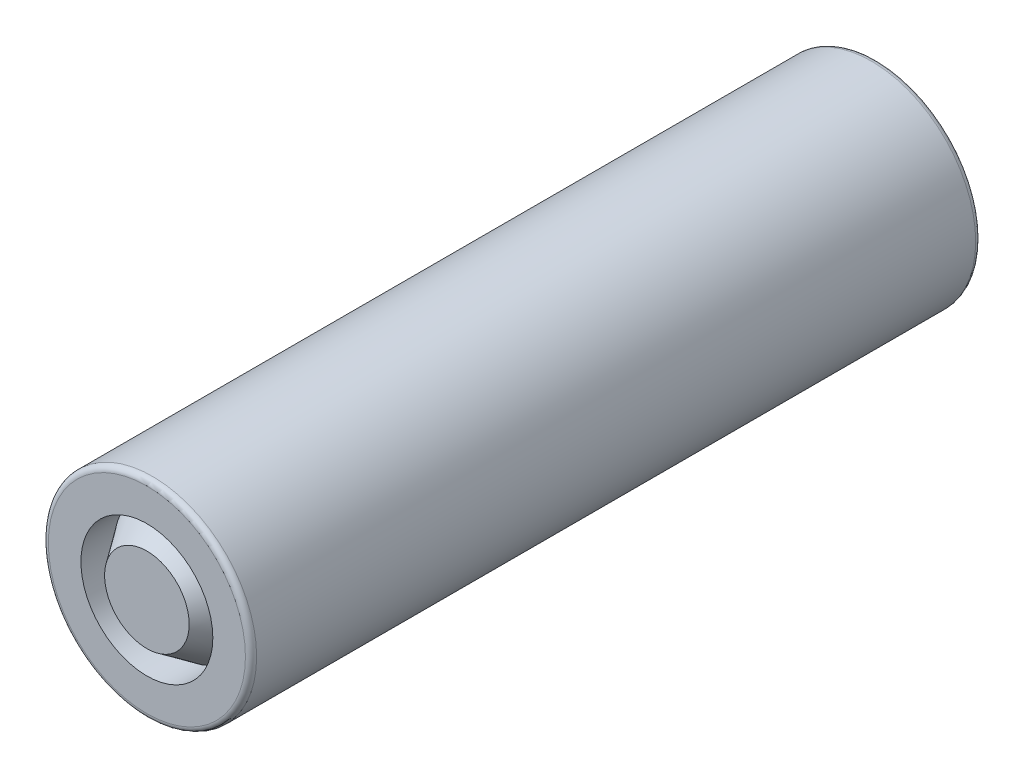
ISO-10303-21;
HEADER;
FILE_DESCRIPTION(('STEP AP214'),'2;1');
FILE_NAME('part.step','',(''),(''),'','','');
FILE_SCHEMA(('AUTOMOTIVE_DESIGN { 1 0 10303 214 1 1 1 1 }'));
ENDSEC;
DATA;
#1=APPLICATION_CONTEXT('core data for automotive mechanical design processes');
#2=APPLICATION_PROTOCOL_DEFINITION('international standard','automotive_design',2000,#1);
#3=PRODUCT_CONTEXT('',#1,'mechanical');
#4=PRODUCT('Part','Part','',(#3));
#5=PRODUCT_RELATED_PRODUCT_CATEGORY('part','',(#4));
#6=PRODUCT_DEFINITION_FORMATION('','',#4);
#7=PRODUCT_DEFINITION_CONTEXT('part definition',#1,'design');
#8=PRODUCT_DEFINITION('design','',#6,#7);
#9=PRODUCT_DEFINITION_SHAPE('','',#8);
#10=(LENGTH_UNIT() NAMED_UNIT(*) SI_UNIT(.MILLI.,.METRE.));
#11=(NAMED_UNIT(*) PLANE_ANGLE_UNIT() SI_UNIT($,.RADIAN.));
#12=(NAMED_UNIT(*) SI_UNIT($,.STERADIAN.) SOLID_ANGLE_UNIT());
#13=UNCERTAINTY_MEASURE_WITH_UNIT(LENGTH_MEASURE(1.E-05),#10,'distance_accuracy_value','');
#14=(GEOMETRIC_REPRESENTATION_CONTEXT(3) GLOBAL_UNCERTAINTY_ASSIGNED_CONTEXT((#13)) GLOBAL_UNIT_ASSIGNED_CONTEXT((#10,
#11,#12)) REPRESENTATION_CONTEXT('',''));
#15=CARTESIAN_POINT('',(0.,0.,0.));
#16=DIRECTION('',(0.,0.,1.));
#17=DIRECTION('',(1.,0.,0.));
#18=AXIS2_PLACEMENT_3D('',#15,#16,#17);
#19=CARTESIAN_POINT('',(0.,0.,0.));
#20=DIRECTION('',(0.,0.,1.));
#21=DIRECTION('',(1.,0.,0.));
#22=AXIS2_PLACEMENT_3D('',#19,#20,#21);
#23=PLANE('',#22);
#24=CARTESIAN_POINT('',(0.,0.,0.));
#25=DIRECTION('',(0.,0.,1.));
#26=DIRECTION('',(1.,0.,0.));
#27=AXIS2_PLACEMENT_3D('',#24,#25,#26);
#28=CIRCLE('',#27,8.8);
#29=CARTESIAN_POINT('',(8.8,0.,0.));
#30=VERTEX_POINT('',#29);
#31=EDGE_CURVE('E10',#30,#30,#28,.T.);
#32=ORIENTED_EDGE('',*,*,#31,.T.);
#33=EDGE_LOOP('',(#32));
#34=FACE_BOUND('',#33,.T.);
#35=CARTESIAN_POINT('',(0.,0.,0.));
#36=DIRECTION('',(0.,0.,1.));
#37=DIRECTION('',(1.,0.,0.));
#38=AXIS2_PLACEMENT_3D('',#35,#36,#37);
#39=CIRCLE('',#38,5.89);
#40=CARTESIAN_POINT('',(5.89,0.,0.));
#41=VERTEX_POINT('',#40);
#42=EDGE_CURVE('E64',#41,#41,#39,.T.);
#43=ORIENTED_EDGE('',*,*,#42,.F.);
#44=EDGE_LOOP('',(#43));
#45=FACE_BOUND('',#44,.T.);
#46=ADVANCED_FACE('F40',(#34,#45),#23,.T.);
#47=CARTESIAN_POINT('',(0.,0.,-65.2));
#48=DIRECTION('',(0.,0.,1.));
#49=DIRECTION('',(1.,0.,0.));
#50=AXIS2_PLACEMENT_3D('',#47,#48,#49);
#51=CYLINDRICAL_SURFACE('',#50,9.3);
#52=CARTESIAN_POINT('',(0.,0.,-64.7));
#53=DIRECTION('',(0.,0.,1.));
#54=DIRECTION('',(1.,0.,0.));
#55=AXIS2_PLACEMENT_3D('',#52,#53,#54);
#56=CIRCLE('',#55,9.3);
#57=CARTESIAN_POINT('',(9.3,0.,-64.7));
#58=VERTEX_POINT('',#57);
#59=EDGE_CURVE('E53',#58,#58,#56,.T.);
#60=ORIENTED_EDGE('',*,*,#59,.T.);
#61=EDGE_LOOP('',(#60));
#62=FACE_BOUND('',#61,.T.);
#63=CARTESIAN_POINT('',(0.,0.,-0.5));
#64=DIRECTION('',(0.,0.,1.));
#65=DIRECTION('',(1.,0.,0.));
#66=AXIS2_PLACEMENT_3D('',#63,#64,#65);
#67=CIRCLE('',#66,9.3);
#68=CARTESIAN_POINT('',(9.3,0.,-0.5));
#69=VERTEX_POINT('',#68);
#70=EDGE_CURVE('E58',#69,#69,#67,.F.);
#71=ORIENTED_EDGE('',*,*,#70,.T.);
#72=EDGE_LOOP('',(#71));
#73=FACE_BOUND('',#72,.T.);
#74=ADVANCED_FACE('F91',(#62,#73),#51,.T.);
#75=CARTESIAN_POINT('',(0.,0.,-65.2));
#76=DIRECTION('',(0.,0.,1.));
#77=DIRECTION('',(1.,0.,0.));
#78=AXIS2_PLACEMENT_3D('',#75,#76,#77);
#79=PLANE('',#78);
#80=CARTESIAN_POINT('',(0.,0.,-65.2));
#81=DIRECTION('',(0.,0.,1.));
#82=DIRECTION('',(1.,0.,0.));
#83=AXIS2_PLACEMENT_3D('',#80,#81,#82);
#84=CIRCLE('',#83,8.8);
#85=CARTESIAN_POINT('',(8.8,0.,-65.2));
#86=VERTEX_POINT('',#85);
#87=EDGE_CURVE('E48',#86,#86,#84,.F.);
#88=ORIENTED_EDGE('',*,*,#87,.T.);
#89=EDGE_LOOP('',(#88));
#90=FACE_BOUND('',#89,.T.);
#91=ADVANCED_FACE('F82',(#90),#79,.F.);
#92=CARTESIAN_POINT('',(0.,0.,55.));
#93=DIRECTION('',(0.,0.,1.));
#94=DIRECTION('',(1.,0.,0.));
#95=AXIS2_PLACEMENT_3D('',#92,#93,#94);
#96=CYLINDRICAL_SURFACE('',#95,5.89);
#97=ORIENTED_EDGE('',*,*,#42,.T.);
#98=EDGE_LOOP('',(#97));
#99=FACE_BOUND('',#98,.T.);
#100=CARTESIAN_POINT('',(0.,0.,-3.));
#101=DIRECTION('',(0.,0.,1.));
#102=DIRECTION('',(1.,0.,0.));
#103=AXIS2_PLACEMENT_3D('',#100,#101,#102);
#104=CIRCLE('',#103,5.89);
#105=CARTESIAN_POINT('',(5.89,0.,-3.));
#106=VERTEX_POINT('',#105);
#107=EDGE_CURVE('E72',#106,#106,#104,.T.);
#108=ORIENTED_EDGE('',*,*,#107,.F.);
#109=EDGE_LOOP('',(#108));
#110=FACE_BOUND('',#109,.T.);
#111=ADVANCED_FACE('F80',(#99,#110),#96,.F.);
#112=CARTESIAN_POINT('',(0.,0.,0.));
#113=DIRECTION('',(0.,0.,-1.));
#114=DIRECTION('',(-1.,0.,0.));
#115=AXIS2_PLACEMENT_3D('',#112,#113,#114);
#116=CONICAL_SURFACE('',#115,3.775,0.614073792524504);
#117=ORIENTED_EDGE('',*,*,#107,.T.);
#118=EDGE_LOOP('',(#117));
#119=FACE_BOUND('',#118,.T.);
#120=CARTESIAN_POINT('',(0.,0.,0.));
#121=DIRECTION('',(0.,0.,1.));
#122=DIRECTION('',(1.,0.,0.));
#123=AXIS2_PLACEMENT_3D('',#120,#121,#122);
#124=CIRCLE('',#123,3.775);
#125=CARTESIAN_POINT('',(3.775,0.,0.));
#126=VERTEX_POINT('',#125);
#127=EDGE_CURVE('E68',#126,#126,#124,.T.);
#128=ORIENTED_EDGE('',*,*,#127,.F.);
#129=EDGE_LOOP('',(#128));
#130=FACE_BOUND('',#129,.T.);
#131=ADVANCED_FACE('F77',(#119,#130),#116,.T.);
#132=ORIENTED_EDGE('',*,*,#127,.T.);
#133=EDGE_LOOP('',(#132));
#134=FACE_BOUND('',#133,.T.);
#135=ADVANCED_FACE('F89',(#134),#23,.T.);
#136=CARTESIAN_POINT('',(0.,0.,-64.7));
#137=DIRECTION('',(0.,0.,1.));
#138=DIRECTION('',(1.,0.,0.));
#139=AXIS2_PLACEMENT_3D('',#136,#137,#138);
#140=TOROIDAL_SURFACE('',#139,8.8,0.5);
#141=ORIENTED_EDGE('',*,*,#87,.F.);
#142=EDGE_LOOP('',(#141));
#143=FACE_BOUND('',#142,.T.);
#144=ORIENTED_EDGE('',*,*,#59,.F.);
#145=EDGE_LOOP('',(#144));
#146=FACE_BOUND('',#145,.T.);
#147=ADVANCED_FACE('F102',(#143,#146),#140,.T.);
#148=CARTESIAN_POINT('',(0.,0.,-0.5));
#149=DIRECTION('',(0.,0.,1.));
#150=DIRECTION('',(1.,0.,0.));
#151=AXIS2_PLACEMENT_3D('',#148,#149,#150);
#152=TOROIDAL_SURFACE('',#151,8.8,0.5);
#153=ORIENTED_EDGE('',*,*,#70,.F.);
#154=EDGE_LOOP('',(#153));
#155=FACE_BOUND('',#154,.T.);
#156=ORIENTED_EDGE('',*,*,#31,.F.);
#157=EDGE_LOOP('',(#156));
#158=FACE_BOUND('',#157,.T.);
#159=ADVANCED_FACE('F42',(#155,#158),#152,.T.);
#160=CLOSED_SHELL('',(#46,#74,#91,#111,#131,#135,#147,#159));
#161=MANIFOLD_SOLID_BREP('B2',#160);
#162=ADVANCED_BREP_SHAPE_REPRESENTATION('',(#18,#161),#14);
#163=SHAPE_DEFINITION_REPRESENTATION(#9,#162);
ENDSEC;
END-ISO-10303-21;
